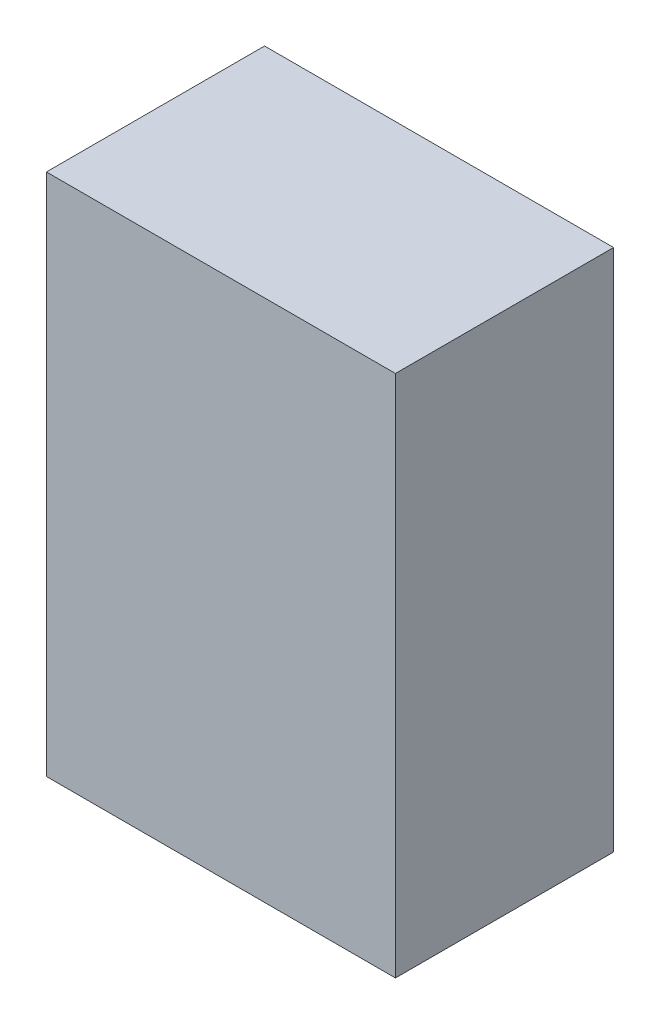
ISO-10303-21;
HEADER;
FILE_DESCRIPTION(('STEP AP214'),'2;1');
FILE_NAME('part.step','',(''),(''),'','','');
FILE_SCHEMA(('AUTOMOTIVE_DESIGN { 1 0 10303 214 1 1 1 1 }'));
ENDSEC;
DATA;
#1=APPLICATION_CONTEXT('core data for automotive mechanical design processes');
#2=APPLICATION_PROTOCOL_DEFINITION('international standard','automotive_design',2000,#1);
#3=PRODUCT_CONTEXT('',#1,'mechanical');
#4=PRODUCT('Part','Part','',(#3));
#5=PRODUCT_RELATED_PRODUCT_CATEGORY('part','',(#4));
#6=PRODUCT_DEFINITION_FORMATION('','',#4);
#7=PRODUCT_DEFINITION_CONTEXT('part definition',#1,'design');
#8=PRODUCT_DEFINITION('design','',#6,#7);
#9=PRODUCT_DEFINITION_SHAPE('','',#8);
#10=(LENGTH_UNIT() NAMED_UNIT(*) SI_UNIT(.MILLI.,.METRE.));
#11=(NAMED_UNIT(*) PLANE_ANGLE_UNIT() SI_UNIT($,.RADIAN.));
#12=(NAMED_UNIT(*) SI_UNIT($,.STERADIAN.) SOLID_ANGLE_UNIT());
#13=UNCERTAINTY_MEASURE_WITH_UNIT(LENGTH_MEASURE(1.E-05),#10,'distance_accuracy_value','');
#14=(GEOMETRIC_REPRESENTATION_CONTEXT(3) GLOBAL_UNCERTAINTY_ASSIGNED_CONTEXT((#13)) GLOBAL_UNIT_ASSIGNED_CONTEXT((#10,
#11,#12)) REPRESENTATION_CONTEXT('',''));
#15=CARTESIAN_POINT('',(0.,0.,0.));
#16=DIRECTION('',(0.,0.,1.));
#17=DIRECTION('',(1.,0.,0.));
#18=AXIS2_PLACEMENT_3D('',#15,#16,#17);
#19=CARTESIAN_POINT('',(0.3999992,0.60000134,0.499999));
#20=DIRECTION('',(0.,0.,1.));
#21=DIRECTION('',(1.,0.,0.));
#22=AXIS2_PLACEMENT_3D('',#19,#20,#21);
#23=PLANE('',#22);
#24=DIRECTION('',(1.,0.,0.));
#25=VECTOR('',#24,1.);
#26=CARTESIAN_POINT('',(0.3999992,-0.5999988,0.499999));
#27=LINE('',#26,#25);
#28=CARTESIAN_POINT('',(0.3999992,-0.5999988,0.499999));
#29=VERTEX_POINT('',#28);
#30=CARTESIAN_POINT('',(-0.3999992,-0.5999988,0.499999));
#31=VERTEX_POINT('',#30);
#32=EDGE_CURVE('E53',#29,#31,#27,.F.);
#33=ORIENTED_EDGE('',*,*,#32,.F.);
#34=DIRECTION('',(0.,1.,0.));
#35=VECTOR('',#34,1.);
#36=CARTESIAN_POINT('',(0.3999992,0.60000134,0.499999));
#37=LINE('',#36,#35);
#38=CARTESIAN_POINT('',(0.3999992,0.60000134,0.499999));
#39=VERTEX_POINT('',#38);
#40=EDGE_CURVE('E68',#39,#29,#37,.F.);
#41=ORIENTED_EDGE('',*,*,#40,.F.);
#42=DIRECTION('',(1.,0.,0.));
#43=VECTOR('',#42,1.);
#44=CARTESIAN_POINT('',(-0.3999992,0.60000134,0.499999));
#45=LINE('',#44,#43);
#46=CARTESIAN_POINT('',(-0.3999992,0.60000134,0.499999));
#47=VERTEX_POINT('',#46);
#48=EDGE_CURVE('E20',#47,#39,#45,.T.);
#49=ORIENTED_EDGE('',*,*,#48,.F.);
#50=DIRECTION('',(0.,1.,0.));
#51=VECTOR('',#50,1.);
#52=CARTESIAN_POINT('',(-0.3999992,-0.5999988,0.499999));
#53=LINE('',#52,#51);
#54=EDGE_CURVE('E58',#31,#47,#53,.T.);
#55=ORIENTED_EDGE('',*,*,#54,.F.);
#56=EDGE_LOOP('',(#33,#41,#49,#55));
#57=FACE_BOUND('',#56,.T.);
#58=ADVANCED_FACE('F17',(#57),#23,.T.);
#59=CARTESIAN_POINT('',(-0.3999992,0.60000134,0.));
#60=DIRECTION('',(0.,1.,0.));
#61=DIRECTION('',(0.,0.,1.));
#62=AXIS2_PLACEMENT_3D('',#59,#60,#61);
#63=PLANE('',#62);
#64=DIRECTION('',(0.,0.,-1.));
#65=VECTOR('',#64,1.);
#66=CARTESIAN_POINT('',(0.3999992,0.60000134,0.));
#67=LINE('',#66,#65);
#68=CARTESIAN_POINT('',(0.3999992,0.60000134,0.));
#69=VERTEX_POINT('',#68);
#70=EDGE_CURVE('E79',#69,#39,#67,.F.);
#71=ORIENTED_EDGE('',*,*,#70,.F.);
#72=DIRECTION('',(1.,0.,0.));
#73=VECTOR('',#72,1.);
#74=CARTESIAN_POINT('',(0.3999992,0.60000134,0.));
#75=LINE('',#74,#73);
#76=CARTESIAN_POINT('',(-0.3999992,0.60000134,0.));
#77=VERTEX_POINT('',#76);
#78=EDGE_CURVE('E74',#69,#77,#75,.F.);
#79=ORIENTED_EDGE('',*,*,#78,.T.);
#80=DIRECTION('',(0.,0.,1.));
#81=VECTOR('',#80,1.);
#82=CARTESIAN_POINT('',(-0.3999992,0.60000134,0.));
#83=LINE('',#82,#81);
#84=EDGE_CURVE('E63',#47,#77,#83,.F.);
#85=ORIENTED_EDGE('',*,*,#84,.F.);
#86=ORIENTED_EDGE('',*,*,#48,.T.);
#87=EDGE_LOOP('',(#71,#79,#85,#86));
#88=FACE_BOUND('',#87,.T.);
#89=ADVANCED_FACE('F73',(#88),#63,.T.);
#90=CARTESIAN_POINT('',(-0.3999992,-0.5999988,0.));
#91=DIRECTION('',(-1.,0.,0.));
#92=DIRECTION('',(0.,0.,1.));
#93=AXIS2_PLACEMENT_3D('',#90,#91,#92);
#94=PLANE('',#93);
#95=ORIENTED_EDGE('',*,*,#84,.T.);
#96=DIRECTION('',(0.,1.,0.));
#97=VECTOR('',#96,1.);
#98=CARTESIAN_POINT('',(-0.3999992,0.60000134,0.));
#99=LINE('',#98,#97);
#100=CARTESIAN_POINT('',(-0.3999992,-0.5999988,0.));
#101=VERTEX_POINT('',#100);
#102=EDGE_CURVE('E84',#77,#101,#99,.F.);
#103=ORIENTED_EDGE('',*,*,#102,.T.);
#104=DIRECTION('',(0.,0.,-1.));
#105=VECTOR('',#104,1.);
#106=CARTESIAN_POINT('',(-0.3999992,-0.5999988,0.));
#107=LINE('',#106,#105);
#108=EDGE_CURVE('E65',#31,#101,#107,.T.);
#109=ORIENTED_EDGE('',*,*,#108,.F.);
#110=ORIENTED_EDGE('',*,*,#54,.T.);
#111=EDGE_LOOP('',(#95,#103,#109,#110));
#112=FACE_BOUND('',#111,.T.);
#113=ADVANCED_FACE('F60',(#112),#94,.T.);
#114=CARTESIAN_POINT('',(0.3999992,-0.5999988,0.));
#115=DIRECTION('',(0.,-1.,0.));
#116=DIRECTION('',(0.,0.,-1.));
#117=AXIS2_PLACEMENT_3D('',#114,#115,#116);
#118=PLANE('',#117);
#119=ORIENTED_EDGE('',*,*,#108,.T.);
#120=DIRECTION('',(1.,0.,0.));
#121=VECTOR('',#120,1.);
#122=CARTESIAN_POINT('',(0.3999992,-0.5999988,0.));
#123=LINE('',#122,#121);
#124=CARTESIAN_POINT('',(0.3999992,-0.5999988,0.));
#125=VERTEX_POINT('',#124);
#126=EDGE_CURVE('E26',#101,#125,#123,.T.);
#127=ORIENTED_EDGE('',*,*,#126,.T.);
#128=DIRECTION('',(0.,0.,-1.));
#129=VECTOR('',#128,1.);
#130=CARTESIAN_POINT('',(0.3999992,-0.5999988,0.));
#131=LINE('',#130,#129);
#132=EDGE_CURVE('E34',#29,#125,#131,.T.);
#133=ORIENTED_EDGE('',*,*,#132,.F.);
#134=ORIENTED_EDGE('',*,*,#32,.T.);
#135=EDGE_LOOP('',(#119,#127,#133,#134));
#136=FACE_BOUND('',#135,.T.);
#137=ADVANCED_FACE('F88',(#136),#118,.T.);
#138=CARTESIAN_POINT('',(0.3999992,0.60000134,0.));
#139=DIRECTION('',(1.,0.,0.));
#140=DIRECTION('',(0.,0.,-1.));
#141=AXIS2_PLACEMENT_3D('',#138,#139,#140);
#142=PLANE('',#141);
#143=ORIENTED_EDGE('',*,*,#132,.T.);
#144=DIRECTION('',(0.,1.,0.));
#145=VECTOR('',#144,1.);
#146=CARTESIAN_POINT('',(0.3999992,0.60000134,0.));
#147=LINE('',#146,#145);
#148=EDGE_CURVE('E11',#125,#69,#147,.T.);
#149=ORIENTED_EDGE('',*,*,#148,.T.);
#150=ORIENTED_EDGE('',*,*,#70,.T.);
#151=ORIENTED_EDGE('',*,*,#40,.T.);
#152=EDGE_LOOP('',(#143,#149,#150,#151));
#153=FACE_BOUND('',#152,.T.);
#154=ADVANCED_FACE('F91',(#153),#142,.T.);
#155=CARTESIAN_POINT('',(0.3999992,0.60000134,0.));
#156=DIRECTION('',(0.,0.,1.));
#157=DIRECTION('',(1.,0.,0.));
#158=AXIS2_PLACEMENT_3D('',#155,#156,#157);
#159=PLANE('',#158);
#160=ORIENTED_EDGE('',*,*,#126,.F.);
#161=ORIENTED_EDGE('',*,*,#102,.F.);
#162=ORIENTED_EDGE('',*,*,#78,.F.);
#163=ORIENTED_EDGE('',*,*,#148,.F.);
#164=EDGE_LOOP('',(#160,#161,#162,#163));
#165=FACE_BOUND('',#164,.T.);
#166=ADVANCED_FACE('F90',(#165),#159,.F.);
#167=CLOSED_SHELL('',(#58,#89,#113,#137,#154,#166));
#168=MANIFOLD_SOLID_BREP('B1',#167);
#169=ADVANCED_BREP_SHAPE_REPRESENTATION('',(#18,#168),#14);
#170=SHAPE_DEFINITION_REPRESENTATION(#9,#169);
ENDSEC;
END-ISO-10303-21;
